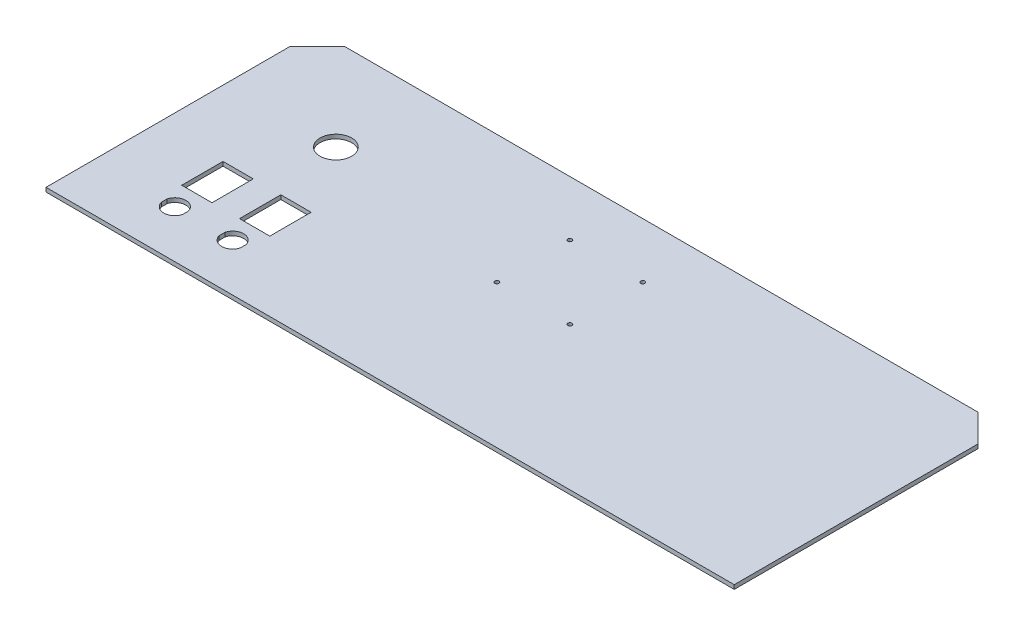
ISO-10303-21;
HEADER;
FILE_DESCRIPTION(('STEP AP214'),'2;1');
FILE_NAME('part.step','',(''),(''),'','','');
FILE_SCHEMA(('AUTOMOTIVE_DESIGN { 1 0 10303 214 1 1 1 1 }'));
ENDSEC;
DATA;
#1=APPLICATION_CONTEXT('core data for automotive mechanical design processes');
#2=APPLICATION_PROTOCOL_DEFINITION('international standard','automotive_design',2000,#1);
#3=PRODUCT_CONTEXT('',#1,'mechanical');
#4=PRODUCT('Part','Part','',(#3));
#5=PRODUCT_RELATED_PRODUCT_CATEGORY('part','',(#4));
#6=PRODUCT_DEFINITION_FORMATION('','',#4);
#7=PRODUCT_DEFINITION_CONTEXT('part definition',#1,'design');
#8=PRODUCT_DEFINITION('design','',#6,#7);
#9=PRODUCT_DEFINITION_SHAPE('','',#8);
#10=(LENGTH_UNIT() NAMED_UNIT(*) SI_UNIT(.MILLI.,.METRE.));
#11=(NAMED_UNIT(*) PLANE_ANGLE_UNIT() SI_UNIT($,.RADIAN.));
#12=(NAMED_UNIT(*) SI_UNIT($,.STERADIAN.) SOLID_ANGLE_UNIT());
#13=UNCERTAINTY_MEASURE_WITH_UNIT(LENGTH_MEASURE(1.E-05),#10,'distance_accuracy_value','');
#14=(GEOMETRIC_REPRESENTATION_CONTEXT(3) GLOBAL_UNCERTAINTY_ASSIGNED_CONTEXT((#13)) GLOBAL_UNIT_ASSIGNED_CONTEXT((#10,
#11,#12)) REPRESENTATION_CONTEXT('',''));
#15=CARTESIAN_POINT('',(0.,0.,0.));
#16=DIRECTION('',(0.,0.,1.));
#17=DIRECTION('',(1.,0.,0.));
#18=AXIS2_PLACEMENT_3D('',#15,#16,#17);
#19=CARTESIAN_POINT('',(0.,3.,0.));
#20=DIRECTION('',(0.,1.,0.));
#21=DIRECTION('',(0.,0.,1.));
#22=AXIS2_PLACEMENT_3D('',#19,#20,#21);
#23=PLANE('',#22);
#24=DIRECTION('',(0.,0.,-1.));
#25=VECTOR('',#24,1.);
#26=CARTESIAN_POINT('',(-172.230501234276,3.,0.));
#27=LINE('',#26,#25);
#28=CARTESIAN_POINT('',(-172.230501234276,3.,66.1202534414211));
#29=VERTEX_POINT('',#28);
#30=CARTESIAN_POINT('',(-172.230501234276,3.,61.779746558579));
#31=VERTEX_POINT('',#30);
#32=EDGE_CURVE('E49',#29,#31,#27,.T.);
#33=ORIENTED_EDGE('',*,*,#32,.F.);
#34=CARTESIAN_POINT('',(-179.930501234276,3.,63.95));
#35=DIRECTION('',(0.,1.,0.));
#36=DIRECTION('',(0.,0.,1.));
#37=AXIS2_PLACEMENT_3D('',#34,#35,#36);
#38=CIRCLE('',#37,8.00000000000001);
#39=CARTESIAN_POINT('',(-187.630501234276,3.,66.1202534414211));
#40=VERTEX_POINT('',#39);
#41=EDGE_CURVE('E204',#40,#29,#38,.T.);
#42=ORIENTED_EDGE('',*,*,#41,.F.);
#43=DIRECTION('',(0.,0.,-1.));
#44=VECTOR('',#43,1.);
#45=CARTESIAN_POINT('',(-187.630501234276,3.,0.));
#46=LINE('',#45,#44);
#47=CARTESIAN_POINT('',(-187.630501234276,3.,61.779746558579));
#48=VERTEX_POINT('',#47);
#49=EDGE_CURVE('E190',#40,#48,#46,.T.);
#50=ORIENTED_EDGE('',*,*,#49,.T.);
#51=EDGE_CURVE('E200',#31,#48,#38,.T.);
#52=ORIENTED_EDGE('',*,*,#51,.F.);
#53=EDGE_LOOP('',(#33,#42,#50,#52));
#54=FACE_BOUND('',#53,.T.);
#55=DIRECTION('',(0.,0.,-1.));
#56=VECTOR('',#55,1.);
#57=CARTESIAN_POINT('',(-214.230501234276,3.,0.));
#58=LINE('',#57,#56);
#59=CARTESIAN_POINT('',(-214.230501234276,3.,66.1202534414211));
#60=VERTEX_POINT('',#59);
#61=CARTESIAN_POINT('',(-214.230501234276,3.,61.779746558579));
#62=VERTEX_POINT('',#61);
#63=EDGE_CURVE('E57',#60,#62,#58,.T.);
#64=ORIENTED_EDGE('',*,*,#63,.F.);
#65=CARTESIAN_POINT('',(-221.930501234276,3.,63.95));
#66=DIRECTION('',(0.,1.,0.));
#67=DIRECTION('',(0.,0.,1.));
#68=AXIS2_PLACEMENT_3D('',#65,#66,#67);
#69=CIRCLE('',#68,8.00000000000001);
#70=CARTESIAN_POINT('',(-229.630501234276,3.,66.1202534414211));
#71=VERTEX_POINT('',#70);
#72=EDGE_CURVE('E232',#71,#60,#69,.T.);
#73=ORIENTED_EDGE('',*,*,#72,.F.);
#74=DIRECTION('',(0.,0.,-1.));
#75=VECTOR('',#74,1.);
#76=CARTESIAN_POINT('',(-229.630501234276,3.,0.));
#77=LINE('',#76,#75);
#78=CARTESIAN_POINT('',(-229.630501234276,3.,61.779746558579));
#79=VERTEX_POINT('',#78);
#80=EDGE_CURVE('E231',#71,#79,#77,.T.);
#81=ORIENTED_EDGE('',*,*,#80,.T.);
#82=EDGE_CURVE('E228',#62,#79,#69,.T.);
#83=ORIENTED_EDGE('',*,*,#82,.F.);
#84=EDGE_LOOP('',(#64,#73,#81,#83));
#85=FACE_BOUND('',#84,.T.);
#86=CARTESIAN_POINT('',(-200.930501234276,3.,-32.0500000000001));
#87=DIRECTION('',(0.,1.,0.));
#88=DIRECTION('',(0.,0.,1.));
#89=AXIS2_PLACEMENT_3D('',#86,#87,#88);
#90=CIRCLE('',#89,11.5);
#91=CARTESIAN_POINT('',(-200.930501234276,3.,-20.5500000000001));
#92=VERTEX_POINT('',#91);
#93=EDGE_CURVE('E273',#92,#92,#90,.T.);
#94=ORIENTED_EDGE('',*,*,#93,.F.);
#95=EDGE_LOOP('',(#94));
#96=FACE_BOUND('',#95,.T.);
#97=CARTESIAN_POINT('',(-57.4305012342762,3.,-5.55000000000012));
#98=DIRECTION('',(0.,1.,0.));
#99=DIRECTION('',(0.,0.,1.));
#100=AXIS2_PLACEMENT_3D('',#97,#98,#99);
#101=CIRCLE('',#100,1.5);
#102=CARTESIAN_POINT('',(-57.4305012342762,3.,-4.05000000000012));
#103=VERTEX_POINT('',#102);
#104=EDGE_CURVE('E326',#103,#103,#101,.T.);
#105=ORIENTED_EDGE('',*,*,#104,.F.);
#106=EDGE_LOOP('',(#105));
#107=FACE_BOUND('',#106,.T.);
#108=CARTESIAN_POINT('',(-57.4305012342762,3.,-58.5500000000001));
#109=DIRECTION('',(0.,1.,0.));
#110=DIRECTION('',(0.,0.,1.));
#111=AXIS2_PLACEMENT_3D('',#108,#109,#110);
#112=CIRCLE('',#111,1.5);
#113=CARTESIAN_POINT('',(-57.4305012342762,3.,-57.0500000000001));
#114=VERTEX_POINT('',#113);
#115=EDGE_CURVE('E319',#114,#114,#112,.T.);
#116=ORIENTED_EDGE('',*,*,#115,.F.);
#117=EDGE_LOOP('',(#116));
#118=FACE_BOUND('',#117,.T.);
#119=CARTESIAN_POINT('',(-4.43050123427619,3.,-58.5500000000001));
#120=DIRECTION('',(0.,1.,0.));
#121=DIRECTION('',(0.,0.,1.));
#122=AXIS2_PLACEMENT_3D('',#119,#120,#121);
#123=CIRCLE('',#122,1.5);
#124=CARTESIAN_POINT('',(-4.43050123427619,3.,-57.0500000000001));
#125=VERTEX_POINT('',#124);
#126=EDGE_CURVE('E318',#125,#125,#123,.T.);
#127=ORIENTED_EDGE('',*,*,#126,.F.);
#128=EDGE_LOOP('',(#127));
#129=FACE_BOUND('',#128,.T.);
#130=CARTESIAN_POINT('',(-4.43050123427619,3.,-5.55000000000012));
#131=DIRECTION('',(0.,1.,0.));
#132=DIRECTION('',(0.,0.,1.));
#133=AXIS2_PLACEMENT_3D('',#130,#131,#132);
#134=CIRCLE('',#133,1.5);
#135=CARTESIAN_POINT('',(-4.43050123427619,3.,-4.05000000000013));
#136=VERTEX_POINT('',#135);
#137=EDGE_CURVE('E322',#136,#136,#134,.T.);
#138=ORIENTED_EDGE('',*,*,#137,.F.);
#139=EDGE_LOOP('',(#138));
#140=FACE_BOUND('',#139,.T.);
#141=DIRECTION('',(-0.707106781186543,0.,-0.707106781186551));
#142=VECTOR('',#141,1.);
#143=CARTESIAN_POINT('',(199.069498765724,3.,-98.5500000000001));
#144=LINE('',#143,#142);
#145=CARTESIAN_POINT('',(219.069498765724,3.,-78.5499999999999));
#146=VERTEX_POINT('',#145);
#147=CARTESIAN_POINT('',(199.069498765724,3.,-98.5500000000001));
#148=VERTEX_POINT('',#147);
#149=EDGE_CURVE('E339',#146,#148,#144,.T.);
#150=ORIENTED_EDGE('',*,*,#149,.T.);
#151=DIRECTION('',(-1.,0.,0.));
#152=VECTOR('',#151,1.);
#153=CARTESIAN_POINT('',(-260.930501234276,3.,-98.5500000000001));
#154=LINE('',#153,#152);
#155=CARTESIAN_POINT('',(-260.930501234276,3.,-98.5500000000001));
#156=VERTEX_POINT('',#155);
#157=EDGE_CURVE('E342',#148,#156,#154,.T.);
#158=ORIENTED_EDGE('',*,*,#157,.T.);
#159=DIRECTION('',(-0.707106781186548,0.,0.707106781186546));
#160=VECTOR('',#159,1.);
#161=CARTESIAN_POINT('',(-280.930501234276,3.,-78.5500000000002));
#162=LINE('',#161,#160);
#163=CARTESIAN_POINT('',(-280.930501234276,3.,-78.5500000000002));
#164=VERTEX_POINT('',#163);
#165=EDGE_CURVE('E345',#156,#164,#162,.T.);
#166=ORIENTED_EDGE('',*,*,#165,.T.);
#167=DIRECTION('',(0.,0.,1.));
#168=VECTOR('',#167,1.);
#169=CARTESIAN_POINT('',(-280.930501234276,3.,98.5500000000001));
#170=LINE('',#169,#168);
#171=CARTESIAN_POINT('',(-280.930501234276,3.,98.5500000000001));
#172=VERTEX_POINT('',#171);
#173=EDGE_CURVE('E347',#164,#172,#170,.T.);
#174=ORIENTED_EDGE('',*,*,#173,.T.);
#175=DIRECTION('',(1.,0.,0.));
#176=VECTOR('',#175,1.);
#177=CARTESIAN_POINT('',(219.069498765724,3.,98.5500000000001));
#178=LINE('',#177,#176);
#179=CARTESIAN_POINT('',(219.069498765724,3.,98.5500000000001));
#180=VERTEX_POINT('',#179);
#181=EDGE_CURVE('E349',#172,#180,#178,.T.);
#182=ORIENTED_EDGE('',*,*,#181,.T.);
#183=DIRECTION('',(0.,0.,-1.));
#184=VECTOR('',#183,1.);
#185=CARTESIAN_POINT('',(219.069498765724,3.,-78.5499999999999));
#186=LINE('',#185,#184);
#187=EDGE_CURVE('E351',#180,#146,#186,.T.);
#188=ORIENTED_EDGE('',*,*,#187,.T.);
#189=EDGE_LOOP('',(#150,#158,#166,#174,#182,#188));
#190=FACE_BOUND('',#189,.T.);
#191=DIRECTION('',(0.,0.,1.));
#192=VECTOR('',#191,1.);
#193=CARTESIAN_POINT('',(-168.930501234276,3.,17.9499999999999));
#194=LINE('',#193,#192);
#195=CARTESIAN_POINT('',(-168.930501234276,3.,17.9499999999999));
#196=VERTEX_POINT('',#195);
#197=CARTESIAN_POINT('',(-168.930501234276,3.,47.9499999999999));
#198=VERTEX_POINT('',#197);
#199=EDGE_CURVE('E298',#196,#198,#194,.T.);
#200=ORIENTED_EDGE('',*,*,#199,.T.);
#201=DIRECTION('',(-1.,0.,0.));
#202=VECTOR('',#201,1.);
#203=CARTESIAN_POINT('',(-168.930501234276,3.,47.9499999999999));
#204=LINE('',#203,#202);
#205=CARTESIAN_POINT('',(-190.930501234276,3.,47.9499999999999));
#206=VERTEX_POINT('',#205);
#207=EDGE_CURVE('E301',#198,#206,#204,.T.);
#208=ORIENTED_EDGE('',*,*,#207,.T.);
#209=DIRECTION('',(0.,0.,-1.));
#210=VECTOR('',#209,1.);
#211=CARTESIAN_POINT('',(-190.930501234276,3.,47.9499999999999));
#212=LINE('',#211,#210);
#213=CARTESIAN_POINT('',(-190.930501234276,3.,17.9499999999999));
#214=VERTEX_POINT('',#213);
#215=EDGE_CURVE('E268',#206,#214,#212,.T.);
#216=ORIENTED_EDGE('',*,*,#215,.T.);
#217=DIRECTION('',(1.,0.,0.));
#218=VECTOR('',#217,1.);
#219=CARTESIAN_POINT('',(-190.930501234276,3.,17.9499999999999));
#220=LINE('',#219,#218);
#221=EDGE_CURVE('E295',#214,#196,#220,.T.);
#222=ORIENTED_EDGE('',*,*,#221,.T.);
#223=EDGE_LOOP('',(#200,#208,#216,#222));
#224=FACE_BOUND('',#223,.T.);
#225=DIRECTION('',(-1.,0.,0.));
#226=VECTOR('',#225,1.);
#227=CARTESIAN_POINT('',(-210.930501234276,3.,47.9499999999999));
#228=LINE('',#227,#226);
#229=CARTESIAN_POINT('',(-210.930501234276,3.,47.9499999999999));
#230=VERTEX_POINT('',#229);
#231=CARTESIAN_POINT('',(-232.930501234276,3.,47.9499999999999));
#232=VERTEX_POINT('',#231);
#233=EDGE_CURVE('E259',#230,#232,#228,.T.);
#234=ORIENTED_EDGE('',*,*,#233,.T.);
#235=DIRECTION('',(0.,0.,-1.));
#236=VECTOR('',#235,1.);
#237=CARTESIAN_POINT('',(-232.930501234276,3.,47.9499999999999));
#238=LINE('',#237,#236);
#239=CARTESIAN_POINT('',(-232.930501234276,3.,17.9499999999999));
#240=VERTEX_POINT('',#239);
#241=EDGE_CURVE('E256',#232,#240,#238,.T.);
#242=ORIENTED_EDGE('',*,*,#241,.T.);
#243=DIRECTION('',(1.,0.,0.));
#244=VECTOR('',#243,1.);
#245=CARTESIAN_POINT('',(-232.930501234276,3.,17.9499999999999));
#246=LINE('',#245,#244);
#247=CARTESIAN_POINT('',(-210.930501234276,3.,17.9499999999999));
#248=VERTEX_POINT('',#247);
#249=EDGE_CURVE('E265',#240,#248,#246,.T.);
#250=ORIENTED_EDGE('',*,*,#249,.T.);
#251=DIRECTION('',(0.,0.,1.));
#252=VECTOR('',#251,1.);
#253=CARTESIAN_POINT('',(-210.930501234276,3.,17.9499999999999));
#254=LINE('',#253,#252);
#255=EDGE_CURVE('E262',#248,#230,#254,.T.);
#256=ORIENTED_EDGE('',*,*,#255,.T.);
#257=EDGE_LOOP('',(#234,#242,#250,#256));
#258=FACE_BOUND('',#257,.T.);
#259=ADVANCED_FACE('F34',(#54,#85,#96,#107,#118,#129,#140,#190,#224,#258),#23,.T.);
#260=CARTESIAN_POINT('',(0.,0.,0.));
#261=DIRECTION('',(0.,1.,0.));
#262=DIRECTION('',(0.,0.,1.));
#263=AXIS2_PLACEMENT_3D('',#260,#261,#262);
#264=PLANE('',#263);
#265=CARTESIAN_POINT('',(-179.930501234276,0.,63.95));
#266=DIRECTION('',(0.,1.,0.));
#267=DIRECTION('',(0.,0.,1.));
#268=AXIS2_PLACEMENT_3D('',#265,#266,#267);
#269=CIRCLE('',#268,8.00000000000001);
#270=CARTESIAN_POINT('',(-172.230501234276,0.,66.1202534414211));
#271=VERTEX_POINT('',#270);
#272=CARTESIAN_POINT('',(-187.630501234276,0.,66.1202534414211));
#273=VERTEX_POINT('',#272);
#274=EDGE_CURVE('E739',#271,#273,#269,.F.);
#275=ORIENTED_EDGE('',*,*,#274,.F.);
#276=DIRECTION('',(0.,0.,1.));
#277=VECTOR('',#276,1.);
#278=CARTESIAN_POINT('',(-172.230501234276,0.,0.));
#279=LINE('',#278,#277);
#280=CARTESIAN_POINT('',(-172.230501234276,0.,61.779746558579));
#281=VERTEX_POINT('',#280);
#282=EDGE_CURVE('E217',#281,#271,#279,.T.);
#283=ORIENTED_EDGE('',*,*,#282,.F.);
#284=CARTESIAN_POINT('',(-179.930501234276,0.,63.95));
#285=DIRECTION('',(0.,1.,0.));
#286=DIRECTION('',(0.,0.,1.));
#287=AXIS2_PLACEMENT_3D('',#284,#285,#286);
#288=CIRCLE('',#287,8.00000000000001);
#289=CARTESIAN_POINT('',(-187.630501234276,0.,61.779746558579));
#290=VERTEX_POINT('',#289);
#291=EDGE_CURVE('E214',#290,#281,#288,.F.);
#292=ORIENTED_EDGE('',*,*,#291,.F.);
#293=DIRECTION('',(0.,0.,1.));
#294=VECTOR('',#293,1.);
#295=CARTESIAN_POINT('',(-187.630501234276,0.,0.));
#296=LINE('',#295,#294);
#297=EDGE_CURVE('E193',#290,#273,#296,.T.);
#298=ORIENTED_EDGE('',*,*,#297,.T.);
#299=EDGE_LOOP('',(#275,#283,#292,#298));
#300=FACE_BOUND('',#299,.T.);
#301=CARTESIAN_POINT('',(-221.930501234276,0.,63.95));
#302=DIRECTION('',(0.,1.,0.));
#303=DIRECTION('',(0.,0.,1.));
#304=AXIS2_PLACEMENT_3D('',#301,#302,#303);
#305=CIRCLE('',#304,8.00000000000001);
#306=CARTESIAN_POINT('',(-214.230501234276,0.,66.1202534414211));
#307=VERTEX_POINT('',#306);
#308=CARTESIAN_POINT('',(-229.630501234276,0.,66.1202534414211));
#309=VERTEX_POINT('',#308);
#310=EDGE_CURVE('E221',#307,#309,#305,.F.);
#311=ORIENTED_EDGE('',*,*,#310,.F.);
#312=DIRECTION('',(0.,0.,1.));
#313=VECTOR('',#312,1.);
#314=CARTESIAN_POINT('',(-214.230501234276,0.,0.));
#315=LINE('',#314,#313);
#316=CARTESIAN_POINT('',(-214.230501234276,0.,61.779746558579));
#317=VERTEX_POINT('',#316);
#318=EDGE_CURVE('E224',#317,#307,#315,.T.);
#319=ORIENTED_EDGE('',*,*,#318,.F.);
#320=CARTESIAN_POINT('',(-221.930501234276,0.,63.95));
#321=DIRECTION('',(0.,1.,0.));
#322=DIRECTION('',(0.,0.,1.));
#323=AXIS2_PLACEMENT_3D('',#320,#321,#322);
#324=CIRCLE('',#323,8.00000000000001);
#325=CARTESIAN_POINT('',(-229.630501234276,0.,61.779746558579));
#326=VERTEX_POINT('',#325);
#327=EDGE_CURVE('E226',#326,#317,#324,.F.);
#328=ORIENTED_EDGE('',*,*,#327,.F.);
#329=DIRECTION('',(0.,0.,1.));
#330=VECTOR('',#329,1.);
#331=CARTESIAN_POINT('',(-229.630501234276,0.,0.));
#332=LINE('',#331,#330);
#333=EDGE_CURVE('E218',#326,#309,#332,.T.);
#334=ORIENTED_EDGE('',*,*,#333,.T.);
#335=EDGE_LOOP('',(#311,#319,#328,#334));
#336=FACE_BOUND('',#335,.T.);
#337=CARTESIAN_POINT('',(-200.930501234276,0.,-32.0500000000001));
#338=DIRECTION('',(0.,1.,0.));
#339=DIRECTION('',(0.,0.,1.));
#340=AXIS2_PLACEMENT_3D('',#337,#338,#339);
#341=CIRCLE('',#340,11.5);
#342=CARTESIAN_POINT('',(-200.930501234276,0.,-20.5500000000001));
#343=VERTEX_POINT('',#342);
#344=EDGE_CURVE('E216',#343,#343,#341,.F.);
#345=ORIENTED_EDGE('',*,*,#344,.F.);
#346=EDGE_LOOP('',(#345));
#347=FACE_BOUND('',#346,.T.);
#348=DIRECTION('',(1.,0.,0.));
#349=VECTOR('',#348,1.);
#350=CARTESIAN_POINT('',(-168.930501234276,0.,47.9499999999999));
#351=LINE('',#350,#349);
#352=CARTESIAN_POINT('',(-190.930501234276,0.,47.9499999999999));
#353=VERTEX_POINT('',#352);
#354=CARTESIAN_POINT('',(-168.930501234276,0.,47.9499999999999));
#355=VERTEX_POINT('',#354);
#356=EDGE_CURVE('E286',#353,#355,#351,.T.);
#357=ORIENTED_EDGE('',*,*,#356,.T.);
#358=DIRECTION('',(0.,0.,-1.));
#359=VECTOR('',#358,1.);
#360=CARTESIAN_POINT('',(-168.930501234276,0.,17.9499999999999));
#361=LINE('',#360,#359);
#362=CARTESIAN_POINT('',(-168.930501234276,0.,17.9499999999999));
#363=VERTEX_POINT('',#362);
#364=EDGE_CURVE('E282',#355,#363,#361,.T.);
#365=ORIENTED_EDGE('',*,*,#364,.T.);
#366=DIRECTION('',(-1.,0.,0.));
#367=VECTOR('',#366,1.);
#368=CARTESIAN_POINT('',(-190.930501234276,0.,17.9499999999999));
#369=LINE('',#368,#367);
#370=CARTESIAN_POINT('',(-190.930501234276,0.,17.9499999999999));
#371=VERTEX_POINT('',#370);
#372=EDGE_CURVE('E285',#363,#371,#369,.T.);
#373=ORIENTED_EDGE('',*,*,#372,.T.);
#374=DIRECTION('',(0.,0.,1.));
#375=VECTOR('',#374,1.);
#376=CARTESIAN_POINT('',(-190.930501234276,0.,47.9499999999999));
#377=LINE('',#376,#375);
#378=EDGE_CURVE('E289',#371,#353,#377,.T.);
#379=ORIENTED_EDGE('',*,*,#378,.T.);
#380=EDGE_LOOP('',(#357,#365,#373,#379));
#381=FACE_BOUND('',#380,.T.);
#382=CARTESIAN_POINT('',(-57.4305012342762,0.,-5.55000000000012));
#383=DIRECTION('',(0.,1.,0.));
#384=DIRECTION('',(0.,0.,1.));
#385=AXIS2_PLACEMENT_3D('',#382,#383,#384);
#386=CIRCLE('',#385,1.5);
#387=CARTESIAN_POINT('',(-57.4305012342762,0.,-4.05000000000012));
#388=VERTEX_POINT('',#387);
#389=EDGE_CURVE('E292',#388,#388,#386,.F.);
#390=ORIENTED_EDGE('',*,*,#389,.F.);
#391=EDGE_LOOP('',(#390));
#392=FACE_BOUND('',#391,.T.);
#393=CARTESIAN_POINT('',(-57.4305012342762,0.,-58.5500000000001));
#394=DIRECTION('',(0.,1.,0.));
#395=DIRECTION('',(0.,0.,1.));
#396=AXIS2_PLACEMENT_3D('',#393,#394,#395);
#397=CIRCLE('',#396,1.5);
#398=CARTESIAN_POINT('',(-57.4305012342762,0.,-57.0500000000001));
#399=VERTEX_POINT('',#398);
#400=EDGE_CURVE('E323',#399,#399,#397,.F.);
#401=ORIENTED_EDGE('',*,*,#400,.F.);
#402=EDGE_LOOP('',(#401));
#403=FACE_BOUND('',#402,.T.);
#404=CARTESIAN_POINT('',(-4.43050123427619,0.,-58.5500000000001));
#405=DIRECTION('',(0.,1.,0.));
#406=DIRECTION('',(0.,0.,1.));
#407=AXIS2_PLACEMENT_3D('',#404,#405,#406);
#408=CIRCLE('',#407,1.5);
#409=CARTESIAN_POINT('',(-4.43050123427619,0.,-57.0500000000001));
#410=VERTEX_POINT('',#409);
#411=EDGE_CURVE('E315',#410,#410,#408,.F.);
#412=ORIENTED_EDGE('',*,*,#411,.F.);
#413=EDGE_LOOP('',(#412));
#414=FACE_BOUND('',#413,.T.);
#415=CARTESIAN_POINT('',(-4.43050123427619,0.,-5.55000000000012));
#416=DIRECTION('',(0.,1.,0.));
#417=DIRECTION('',(0.,0.,1.));
#418=AXIS2_PLACEMENT_3D('',#415,#416,#417);
#419=CIRCLE('',#418,1.5);
#420=CARTESIAN_POINT('',(-4.43050123427619,0.,-4.05000000000013));
#421=VERTEX_POINT('',#420);
#422=EDGE_CURVE('E335',#421,#421,#419,.F.);
#423=ORIENTED_EDGE('',*,*,#422,.F.);
#424=EDGE_LOOP('',(#423));
#425=FACE_BOUND('',#424,.T.);
#426=DIRECTION('',(-0.707106781186543,0.,-0.707106781186551));
#427=VECTOR('',#426,1.);
#428=CARTESIAN_POINT('',(199.069498765724,0.,-98.5500000000001));
#429=LINE('',#428,#427);
#430=CARTESIAN_POINT('',(219.069498765724,0.,-78.5499999999999));
#431=VERTEX_POINT('',#430);
#432=CARTESIAN_POINT('',(199.069498765724,0.,-98.5500000000001));
#433=VERTEX_POINT('',#432);
#434=EDGE_CURVE('E338',#431,#433,#429,.T.);
#435=ORIENTED_EDGE('',*,*,#434,.F.);
#436=DIRECTION('',(0.,0.,-1.));
#437=VECTOR('',#436,1.);
#438=CARTESIAN_POINT('',(219.069498765724,0.,-78.5499999999999));
#439=LINE('',#438,#437);
#440=CARTESIAN_POINT('',(219.069498765724,0.,98.5500000000001));
#441=VERTEX_POINT('',#440);
#442=EDGE_CURVE('E343',#441,#431,#439,.T.);
#443=ORIENTED_EDGE('',*,*,#442,.F.);
#444=DIRECTION('',(1.,0.,0.));
#445=VECTOR('',#444,1.);
#446=CARTESIAN_POINT('',(219.069498765724,0.,98.5500000000001));
#447=LINE('',#446,#445);
#448=CARTESIAN_POINT('',(-280.930501234276,0.,98.5500000000001));
#449=VERTEX_POINT('',#448);
#450=EDGE_CURVE('E362',#449,#441,#447,.T.);
#451=ORIENTED_EDGE('',*,*,#450,.F.);
#452=DIRECTION('',(0.,0.,1.));
#453=VECTOR('',#452,1.);
#454=CARTESIAN_POINT('',(-280.930501234276,0.,98.5500000000001));
#455=LINE('',#454,#453);
#456=CARTESIAN_POINT('',(-280.930501234276,0.,-78.5500000000002));
#457=VERTEX_POINT('',#456);
#458=EDGE_CURVE('E360',#457,#449,#455,.T.);
#459=ORIENTED_EDGE('',*,*,#458,.F.);
#460=DIRECTION('',(-0.707106781186548,0.,0.707106781186546));
#461=VECTOR('',#460,1.);
#462=CARTESIAN_POINT('',(-280.930501234276,0.,-78.5500000000002));
#463=LINE('',#462,#461);
#464=CARTESIAN_POINT('',(-260.930501234276,0.,-98.5500000000001));
#465=VERTEX_POINT('',#464);
#466=EDGE_CURVE('E358',#465,#457,#463,.T.);
#467=ORIENTED_EDGE('',*,*,#466,.F.);
#468=DIRECTION('',(-1.,0.,0.));
#469=VECTOR('',#468,1.);
#470=CARTESIAN_POINT('',(-260.930501234276,0.,-98.5500000000001));
#471=LINE('',#470,#469);
#472=EDGE_CURVE('E356',#433,#465,#471,.T.);
#473=ORIENTED_EDGE('',*,*,#472,.F.);
#474=EDGE_LOOP('',(#435,#443,#451,#459,#467,#473));
#475=FACE_BOUND('',#474,.T.);
#476=DIRECTION('',(0.,0.,1.));
#477=VECTOR('',#476,1.);
#478=CARTESIAN_POINT('',(-232.930501234276,0.,47.9499999999999));
#479=LINE('',#478,#477);
#480=CARTESIAN_POINT('',(-232.930501234276,0.,17.9499999999999));
#481=VERTEX_POINT('',#480);
#482=CARTESIAN_POINT('',(-232.930501234276,0.,47.9499999999999));
#483=VERTEX_POINT('',#482);
#484=EDGE_CURVE('E243',#481,#483,#479,.T.);
#485=ORIENTED_EDGE('',*,*,#484,.T.);
#486=DIRECTION('',(1.,0.,0.));
#487=VECTOR('',#486,1.);
#488=CARTESIAN_POINT('',(-210.930501234276,0.,47.9499999999999));
#489=LINE('',#488,#487);
#490=CARTESIAN_POINT('',(-210.930501234276,0.,47.9499999999999));
#491=VERTEX_POINT('',#490);
#492=EDGE_CURVE('E247',#483,#491,#489,.T.);
#493=ORIENTED_EDGE('',*,*,#492,.T.);
#494=DIRECTION('',(0.,0.,-1.));
#495=VECTOR('',#494,1.);
#496=CARTESIAN_POINT('',(-210.930501234276,0.,17.9499999999999));
#497=LINE('',#496,#495);
#498=CARTESIAN_POINT('',(-210.930501234276,0.,17.9499999999999));
#499=VERTEX_POINT('',#498);
#500=EDGE_CURVE('E272',#491,#499,#497,.T.);
#501=ORIENTED_EDGE('',*,*,#500,.T.);
#502=DIRECTION('',(-1.,0.,0.));
#503=VECTOR('',#502,1.);
#504=CARTESIAN_POINT('',(-232.930501234276,0.,17.9499999999999));
#505=LINE('',#504,#503);
#506=EDGE_CURVE('E269',#499,#481,#505,.T.);
#507=ORIENTED_EDGE('',*,*,#506,.T.);
#508=EDGE_LOOP('',(#485,#493,#501,#507));
#509=FACE_BOUND('',#508,.T.);
#510=ADVANCED_FACE('F386',(#300,#336,#347,#381,#392,#403,#414,#425,#475,#509),#264,.F.);
#511=CARTESIAN_POINT('',(199.069498765724,3.,-98.5500000000001));
#512=DIRECTION('',(-0.707106781186551,0.,0.707106781186543));
#513=DIRECTION('',(0.707106781186544,0.,0.707106781186552));
#514=AXIS2_PLACEMENT_3D('',#511,#512,#513);
#515=PLANE('',#514);
#516=ORIENTED_EDGE('',*,*,#434,.T.);
#517=DIRECTION('',(0.,-1.,0.));
#518=VECTOR('',#517,1.);
#519=CARTESIAN_POINT('',(199.069498765724,3.,-98.5500000000001));
#520=LINE('',#519,#518);
#521=EDGE_CURVE('E11',#148,#433,#520,.T.);
#522=ORIENTED_EDGE('',*,*,#521,.F.);
#523=ORIENTED_EDGE('',*,*,#149,.F.);
#524=DIRECTION('',(0.,-1.,0.));
#525=VECTOR('',#524,1.);
#526=CARTESIAN_POINT('',(219.069498765724,3.,-78.5499999999999));
#527=LINE('',#526,#525);
#528=EDGE_CURVE('E353',#146,#431,#527,.T.);
#529=ORIENTED_EDGE('',*,*,#528,.T.);
#530=EDGE_LOOP('',(#516,#522,#523,#529));
#531=FACE_BOUND('',#530,.T.);
#532=ADVANCED_FACE('F36',(#531),#515,.F.);
#533=CARTESIAN_POINT('',(-260.930501234276,3.,-98.5500000000001));
#534=DIRECTION('',(0.,0.,1.));
#535=DIRECTION('',(1.,0.,0.));
#536=AXIS2_PLACEMENT_3D('',#533,#534,#535);
#537=PLANE('',#536);
#538=ORIENTED_EDGE('',*,*,#472,.T.);
#539=DIRECTION('',(0.,-1.,0.));
#540=VECTOR('',#539,1.);
#541=CARTESIAN_POINT('',(-260.930501234276,3.,-98.5500000000001));
#542=LINE('',#541,#540);
#543=EDGE_CURVE('E42',#156,#465,#542,.T.);
#544=ORIENTED_EDGE('',*,*,#543,.F.);
#545=ORIENTED_EDGE('',*,*,#157,.F.);
#546=ORIENTED_EDGE('',*,*,#521,.T.);
#547=EDGE_LOOP('',(#538,#544,#545,#546));
#548=FACE_BOUND('',#547,.T.);
#549=ADVANCED_FACE('F404',(#548),#537,.F.);
#550=CARTESIAN_POINT('',(-280.930501234276,3.,-78.5500000000002));
#551=DIRECTION('',(0.707106781186547,0.,0.707106781186549));
#552=DIRECTION('',(0.707106781186549,0.,-0.707106781186547));
#553=AXIS2_PLACEMENT_3D('',#550,#551,#552);
#554=PLANE('',#553);
#555=ORIENTED_EDGE('',*,*,#466,.T.);
#556=DIRECTION('',(0.,-1.,0.));
#557=VECTOR('',#556,1.);
#558=CARTESIAN_POINT('',(-280.930501234276,3.,-78.5500000000002));
#559=LINE('',#558,#557);
#560=EDGE_CURVE('E373',#164,#457,#559,.T.);
#561=ORIENTED_EDGE('',*,*,#560,.F.);
#562=ORIENTED_EDGE('',*,*,#165,.F.);
#563=ORIENTED_EDGE('',*,*,#543,.T.);
#564=EDGE_LOOP('',(#555,#561,#562,#563));
#565=FACE_BOUND('',#564,.T.);
#566=ADVANCED_FACE('F380',(#565),#554,.F.);
#567=CARTESIAN_POINT('',(-280.930501234276,3.,98.5500000000001));
#568=DIRECTION('',(1.,0.,0.));
#569=DIRECTION('',(0.,0.,-1.));
#570=AXIS2_PLACEMENT_3D('',#567,#568,#569);
#571=PLANE('',#570);
#572=ORIENTED_EDGE('',*,*,#458,.T.);
#573=DIRECTION('',(0.,-1.,0.));
#574=VECTOR('',#573,1.);
#575=CARTESIAN_POINT('',(-280.930501234276,3.,98.5500000000001));
#576=LINE('',#575,#574);
#577=EDGE_CURVE('E370',#172,#449,#576,.T.);
#578=ORIENTED_EDGE('',*,*,#577,.F.);
#579=ORIENTED_EDGE('',*,*,#173,.F.);
#580=ORIENTED_EDGE('',*,*,#560,.T.);
#581=EDGE_LOOP('',(#572,#578,#579,#580));
#582=FACE_BOUND('',#581,.T.);
#583=ADVANCED_FACE('F392',(#582),#571,.F.);
#584=CARTESIAN_POINT('',(219.069498765724,3.,98.5500000000001));
#585=DIRECTION('',(0.,0.,-1.));
#586=DIRECTION('',(-1.,0.,0.));
#587=AXIS2_PLACEMENT_3D('',#584,#585,#586);
#588=PLANE('',#587);
#589=ORIENTED_EDGE('',*,*,#450,.T.);
#590=DIRECTION('',(0.,-1.,0.));
#591=VECTOR('',#590,1.);
#592=CARTESIAN_POINT('',(219.069498765724,3.,98.5500000000001));
#593=LINE('',#592,#591);
#594=EDGE_CURVE('E367',#180,#441,#593,.T.);
#595=ORIENTED_EDGE('',*,*,#594,.F.);
#596=ORIENTED_EDGE('',*,*,#181,.F.);
#597=ORIENTED_EDGE('',*,*,#577,.T.);
#598=EDGE_LOOP('',(#589,#595,#596,#597));
#599=FACE_BOUND('',#598,.T.);
#600=ADVANCED_FACE('F396',(#599),#588,.F.);
#601=CARTESIAN_POINT('',(219.069498765724,3.,-78.5499999999999));
#602=DIRECTION('',(-1.,0.,0.));
#603=DIRECTION('',(0.,0.,1.));
#604=AXIS2_PLACEMENT_3D('',#601,#602,#603);
#605=PLANE('',#604);
#606=ORIENTED_EDGE('',*,*,#442,.T.);
#607=ORIENTED_EDGE('',*,*,#528,.F.);
#608=ORIENTED_EDGE('',*,*,#187,.F.);
#609=ORIENTED_EDGE('',*,*,#594,.T.);
#610=EDGE_LOOP('',(#606,#607,#608,#609));
#611=FACE_BOUND('',#610,.T.);
#612=ADVANCED_FACE('F407',(#611),#605,.F.);
#613=CARTESIAN_POINT('',(-4.43050123427619,-4.24264068711929,-5.55000000000012));
#614=DIRECTION('',(0.,1.,0.));
#615=DIRECTION('',(0.,0.,1.));
#616=AXIS2_PLACEMENT_3D('',#613,#614,#615);
#617=CYLINDRICAL_SURFACE('',#616,1.5);
#618=ORIENTED_EDGE('',*,*,#422,.T.);
#619=EDGE_LOOP('',(#618));
#620=FACE_BOUND('',#619,.T.);
#621=ORIENTED_EDGE('',*,*,#137,.T.);
#622=EDGE_LOOP('',(#621));
#623=FACE_BOUND('',#622,.T.);
#624=ADVANCED_FACE('F409',(#620,#623),#617,.F.);
#625=CARTESIAN_POINT('',(-4.43050123427619,-4.24264068711929,-58.5500000000001));
#626=DIRECTION('',(0.,1.,0.));
#627=DIRECTION('',(0.,0.,1.));
#628=AXIS2_PLACEMENT_3D('',#625,#626,#627);
#629=CYLINDRICAL_SURFACE('',#628,1.5);
#630=ORIENTED_EDGE('',*,*,#411,.T.);
#631=EDGE_LOOP('',(#630));
#632=FACE_BOUND('',#631,.T.);
#633=ORIENTED_EDGE('',*,*,#126,.T.);
#634=EDGE_LOOP('',(#633));
#635=FACE_BOUND('',#634,.T.);
#636=ADVANCED_FACE('F415',(#632,#635),#629,.F.);
#637=CARTESIAN_POINT('',(-57.4305012342762,-4.24264068711929,-58.5500000000001));
#638=DIRECTION('',(0.,1.,0.));
#639=DIRECTION('',(0.,0.,1.));
#640=AXIS2_PLACEMENT_3D('',#637,#638,#639);
#641=CYLINDRICAL_SURFACE('',#640,1.5);
#642=ORIENTED_EDGE('',*,*,#400,.T.);
#643=EDGE_LOOP('',(#642));
#644=FACE_BOUND('',#643,.T.);
#645=ORIENTED_EDGE('',*,*,#115,.T.);
#646=EDGE_LOOP('',(#645));
#647=FACE_BOUND('',#646,.T.);
#648=ADVANCED_FACE('F431',(#644,#647),#641,.F.);
#649=CARTESIAN_POINT('',(-57.4305012342762,-4.24264068711929,-5.55000000000012));
#650=DIRECTION('',(0.,1.,0.));
#651=DIRECTION('',(0.,0.,1.));
#652=AXIS2_PLACEMENT_3D('',#649,#650,#651);
#653=CYLINDRICAL_SURFACE('',#652,1.5);
#654=ORIENTED_EDGE('',*,*,#389,.T.);
#655=EDGE_LOOP('',(#654));
#656=FACE_BOUND('',#655,.T.);
#657=ORIENTED_EDGE('',*,*,#104,.T.);
#658=EDGE_LOOP('',(#657));
#659=FACE_BOUND('',#658,.T.);
#660=ADVANCED_FACE('F427',(#656,#659),#653,.F.);
#661=CARTESIAN_POINT('',(-168.930501234276,-37.2021504754766,47.9499999999999));
#662=DIRECTION('',(0.,0.,-1.));
#663=DIRECTION('',(-1.,0.,0.));
#664=AXIS2_PLACEMENT_3D('',#661,#662,#663);
#665=PLANE('',#664);
#666=DIRECTION('',(0.,1.,0.));
#667=VECTOR('',#666,1.);
#668=CARTESIAN_POINT('',(-190.930501234276,-37.2021504754766,47.9499999999999));
#669=LINE('',#668,#667);
#670=EDGE_CURVE('E304',#353,#206,#669,.T.);
#671=ORIENTED_EDGE('',*,*,#670,.T.);
#672=ORIENTED_EDGE('',*,*,#207,.F.);
#673=DIRECTION('',(0.,1.,0.));
#674=VECTOR('',#673,1.);
#675=CARTESIAN_POINT('',(-168.930501234276,-37.2021504754766,47.9499999999999));
#676=LINE('',#675,#674);
#677=EDGE_CURVE('E306',#355,#198,#676,.T.);
#678=ORIENTED_EDGE('',*,*,#677,.F.);
#679=ORIENTED_EDGE('',*,*,#356,.F.);
#680=EDGE_LOOP('',(#671,#672,#678,#679));
#681=FACE_BOUND('',#680,.T.);
#682=ADVANCED_FACE('F430',(#681),#665,.T.);
#683=CARTESIAN_POINT('',(-168.930501234276,-37.2021504754766,17.9499999999999));
#684=DIRECTION('',(-1.,0.,0.));
#685=DIRECTION('',(0.,0.,1.));
#686=AXIS2_PLACEMENT_3D('',#683,#684,#685);
#687=PLANE('',#686);
#688=ORIENTED_EDGE('',*,*,#677,.T.);
#689=ORIENTED_EDGE('',*,*,#199,.F.);
#690=DIRECTION('',(0.,1.,0.));
#691=VECTOR('',#690,1.);
#692=CARTESIAN_POINT('',(-168.930501234276,-37.2021504754766,17.9499999999999));
#693=LINE('',#692,#691);
#694=EDGE_CURVE('E308',#363,#196,#693,.T.);
#695=ORIENTED_EDGE('',*,*,#694,.F.);
#696=ORIENTED_EDGE('',*,*,#364,.F.);
#697=EDGE_LOOP('',(#688,#689,#695,#696));
#698=FACE_BOUND('',#697,.T.);
#699=ADVANCED_FACE('F447',(#698),#687,.T.);
#700=CARTESIAN_POINT('',(-190.930501234276,-37.2021504754766,17.9499999999999));
#701=DIRECTION('',(0.,0.,1.));
#702=DIRECTION('',(1.,0.,0.));
#703=AXIS2_PLACEMENT_3D('',#700,#701,#702);
#704=PLANE('',#703);
#705=ORIENTED_EDGE('',*,*,#694,.T.);
#706=ORIENTED_EDGE('',*,*,#221,.F.);
#707=DIRECTION('',(0.,1.,0.));
#708=VECTOR('',#707,1.);
#709=CARTESIAN_POINT('',(-190.930501234276,-37.2021504754766,17.9499999999999));
#710=LINE('',#709,#708);
#711=EDGE_CURVE('E310',#371,#214,#710,.T.);
#712=ORIENTED_EDGE('',*,*,#711,.F.);
#713=ORIENTED_EDGE('',*,*,#372,.F.);
#714=EDGE_LOOP('',(#705,#706,#712,#713));
#715=FACE_BOUND('',#714,.T.);
#716=ADVANCED_FACE('F443',(#715),#704,.T.);
#717=CARTESIAN_POINT('',(-190.930501234276,-37.2021504754766,47.9499999999999));
#718=DIRECTION('',(1.,0.,0.));
#719=DIRECTION('',(0.,0.,-1.));
#720=AXIS2_PLACEMENT_3D('',#717,#718,#719);
#721=PLANE('',#720);
#722=ORIENTED_EDGE('',*,*,#711,.T.);
#723=ORIENTED_EDGE('',*,*,#215,.F.);
#724=ORIENTED_EDGE('',*,*,#670,.F.);
#725=ORIENTED_EDGE('',*,*,#378,.F.);
#726=EDGE_LOOP('',(#722,#723,#724,#725));
#727=FACE_BOUND('',#726,.T.);
#728=ADVANCED_FACE('F439',(#727),#721,.T.);
#729=CARTESIAN_POINT('',(-232.930501234276,-37.2021504754766,47.9499999999999));
#730=DIRECTION('',(1.,0.,0.));
#731=DIRECTION('',(0.,0.,-1.));
#732=AXIS2_PLACEMENT_3D('',#729,#730,#731);
#733=PLANE('',#732);
#734=DIRECTION('',(0.,1.,0.));
#735=VECTOR('',#734,1.);
#736=CARTESIAN_POINT('',(-232.930501234276,-37.2021504754766,17.9499999999999));
#737=LINE('',#736,#735);
#738=EDGE_CURVE('E254',#481,#240,#737,.T.);
#739=ORIENTED_EDGE('',*,*,#738,.T.);
#740=ORIENTED_EDGE('',*,*,#241,.F.);
#741=DIRECTION('',(0.,1.,0.));
#742=VECTOR('',#741,1.);
#743=CARTESIAN_POINT('',(-232.930501234276,-37.2021504754766,47.9499999999999));
#744=LINE('',#743,#742);
#745=EDGE_CURVE('E252',#483,#232,#744,.T.);
#746=ORIENTED_EDGE('',*,*,#745,.F.);
#747=ORIENTED_EDGE('',*,*,#484,.F.);
#748=EDGE_LOOP('',(#739,#740,#746,#747));
#749=FACE_BOUND('',#748,.T.);
#750=ADVANCED_FACE('F442',(#749),#733,.T.);
#751=CARTESIAN_POINT('',(-210.930501234276,-37.2021504754766,47.9499999999999));
#752=DIRECTION('',(0.,0.,-1.));
#753=DIRECTION('',(-1.,0.,0.));
#754=AXIS2_PLACEMENT_3D('',#751,#752,#753);
#755=PLANE('',#754);
#756=ORIENTED_EDGE('',*,*,#745,.T.);
#757=ORIENTED_EDGE('',*,*,#233,.F.);
#758=DIRECTION('',(0.,1.,0.));
#759=VECTOR('',#758,1.);
#760=CARTESIAN_POINT('',(-210.930501234276,-37.2021504754766,47.9499999999999));
#761=LINE('',#760,#759);
#762=EDGE_CURVE('E250',#491,#230,#761,.T.);
#763=ORIENTED_EDGE('',*,*,#762,.F.);
#764=ORIENTED_EDGE('',*,*,#492,.F.);
#765=EDGE_LOOP('',(#756,#757,#763,#764));
#766=FACE_BOUND('',#765,.T.);
#767=ADVANCED_FACE('F463',(#766),#755,.T.);
#768=CARTESIAN_POINT('',(-210.930501234276,-37.2021504754766,17.9499999999999));
#769=DIRECTION('',(-1.,0.,0.));
#770=DIRECTION('',(0.,0.,1.));
#771=AXIS2_PLACEMENT_3D('',#768,#769,#770);
#772=PLANE('',#771);
#773=ORIENTED_EDGE('',*,*,#762,.T.);
#774=ORIENTED_EDGE('',*,*,#255,.F.);
#775=DIRECTION('',(0.,1.,0.));
#776=VECTOR('',#775,1.);
#777=CARTESIAN_POINT('',(-210.930501234276,-37.2021504754766,17.9499999999999));
#778=LINE('',#777,#776);
#779=EDGE_CURVE('E246',#499,#248,#778,.T.);
#780=ORIENTED_EDGE('',*,*,#779,.F.);
#781=ORIENTED_EDGE('',*,*,#500,.F.);
#782=EDGE_LOOP('',(#773,#774,#780,#781));
#783=FACE_BOUND('',#782,.T.);
#784=ADVANCED_FACE('F467',(#783),#772,.T.);
#785=CARTESIAN_POINT('',(-232.930501234276,-37.2021504754766,17.9499999999999));
#786=DIRECTION('',(0.,0.,1.));
#787=DIRECTION('',(1.,0.,0.));
#788=AXIS2_PLACEMENT_3D('',#785,#786,#787);
#789=PLANE('',#788);
#790=ORIENTED_EDGE('',*,*,#779,.T.);
#791=ORIENTED_EDGE('',*,*,#249,.F.);
#792=ORIENTED_EDGE('',*,*,#738,.F.);
#793=ORIENTED_EDGE('',*,*,#506,.F.);
#794=EDGE_LOOP('',(#790,#791,#792,#793));
#795=FACE_BOUND('',#794,.T.);
#796=ADVANCED_FACE('F459',(#795),#789,.T.);
#797=CARTESIAN_POINT('',(-200.930501234276,-37.2021504754766,-32.0500000000001));
#798=DIRECTION('',(0.,1.,0.));
#799=DIRECTION('',(0.,0.,1.));
#800=AXIS2_PLACEMENT_3D('',#797,#798,#799);
#801=CYLINDRICAL_SURFACE('',#800,11.5);
#802=ORIENTED_EDGE('',*,*,#344,.T.);
#803=EDGE_LOOP('',(#802));
#804=FACE_BOUND('',#803,.T.);
#805=ORIENTED_EDGE('',*,*,#93,.T.);
#806=EDGE_LOOP('',(#805));
#807=FACE_BOUND('',#806,.T.);
#808=ADVANCED_FACE('F455',(#804,#807),#801,.F.);
#809=CARTESIAN_POINT('',(-214.230501234276,-22.2072060376807,0.));
#810=DIRECTION('',(1.,0.,0.));
#811=DIRECTION('',(0.,0.,-1.));
#812=AXIS2_PLACEMENT_3D('',#809,#810,#811);
#813=PLANE('',#812);
#814=ORIENTED_EDGE('',*,*,#318,.T.);
#815=DIRECTION('',(0.,1.,0.));
#816=VECTOR('',#815,1.);
#817=CARTESIAN_POINT('',(-214.230501234276,-22.2072060376807,66.1202534414211));
#818=LINE('',#817,#816);
#819=EDGE_CURVE('E222',#307,#60,#818,.T.);
#820=ORIENTED_EDGE('',*,*,#819,.T.);
#821=ORIENTED_EDGE('',*,*,#63,.T.);
#822=DIRECTION('',(0.,1.,0.));
#823=VECTOR('',#822,1.);
#824=CARTESIAN_POINT('',(-214.230501234276,-22.2072060376807,61.779746558579));
#825=LINE('',#824,#823);
#826=EDGE_CURVE('E240',#317,#62,#825,.T.);
#827=ORIENTED_EDGE('',*,*,#826,.F.);
#828=EDGE_LOOP('',(#814,#820,#821,#827));
#829=FACE_BOUND('',#828,.T.);
#830=ADVANCED_FACE('F458',(#829),#813,.F.);
#831=CARTESIAN_POINT('',(-221.930501234276,-22.2072060376807,63.95));
#832=DIRECTION('',(0.,1.,0.));
#833=DIRECTION('',(0.,0.,1.));
#834=AXIS2_PLACEMENT_3D('',#831,#832,#833);
#835=CYLINDRICAL_SURFACE('',#834,8.00000000000001);
#836=ORIENTED_EDGE('',*,*,#310,.T.);
#837=DIRECTION('',(0.,1.,0.));
#838=VECTOR('',#837,1.);
#839=CARTESIAN_POINT('',(-229.630501234276,-22.2072060376807,66.1202534414211));
#840=LINE('',#839,#838);
#841=EDGE_CURVE('E236',#309,#71,#840,.T.);
#842=ORIENTED_EDGE('',*,*,#841,.T.);
#843=ORIENTED_EDGE('',*,*,#72,.T.);
#844=ORIENTED_EDGE('',*,*,#819,.F.);
#845=EDGE_LOOP('',(#836,#842,#843,#844));
#846=FACE_BOUND('',#845,.T.);
#847=ADVANCED_FACE('F477',(#846),#835,.F.);
#848=CARTESIAN_POINT('',(-229.630501234276,-22.2072060376807,0.));
#849=DIRECTION('',(1.,0.,0.));
#850=DIRECTION('',(0.,0.,-1.));
#851=AXIS2_PLACEMENT_3D('',#848,#849,#850);
#852=PLANE('',#851);
#853=DIRECTION('',(0.,1.,0.));
#854=VECTOR('',#853,1.);
#855=CARTESIAN_POINT('',(-229.630501234276,-22.2072060376807,61.779746558579));
#856=LINE('',#855,#854);
#857=EDGE_CURVE('E238',#326,#79,#856,.T.);
#858=ORIENTED_EDGE('',*,*,#857,.T.);
#859=ORIENTED_EDGE('',*,*,#80,.F.);
#860=ORIENTED_EDGE('',*,*,#841,.F.);
#861=ORIENTED_EDGE('',*,*,#333,.F.);
#862=EDGE_LOOP('',(#858,#859,#860,#861));
#863=FACE_BOUND('',#862,.T.);
#864=ADVANCED_FACE('F478',(#863),#852,.T.);
#865=ORIENTED_EDGE('',*,*,#327,.T.);
#866=ORIENTED_EDGE('',*,*,#826,.T.);
#867=ORIENTED_EDGE('',*,*,#82,.T.);
#868=ORIENTED_EDGE('',*,*,#857,.F.);
#869=EDGE_LOOP('',(#865,#866,#867,#868));
#870=FACE_BOUND('',#869,.T.);
#871=ADVANCED_FACE('F481',(#870),#835,.F.);
#872=CARTESIAN_POINT('',(-172.230501234276,-22.2072060376807,0.));
#873=DIRECTION('',(1.,0.,0.));
#874=DIRECTION('',(0.,0.,-1.));
#875=AXIS2_PLACEMENT_3D('',#872,#873,#874);
#876=PLANE('',#875);
#877=ORIENTED_EDGE('',*,*,#282,.T.);
#878=DIRECTION('',(0.,1.,0.));
#879=VECTOR('',#878,1.);
#880=CARTESIAN_POINT('',(-172.230501234276,-22.2072060376807,66.1202534414211));
#881=LINE('',#880,#879);
#882=EDGE_CURVE('E210',#271,#29,#881,.T.);
#883=ORIENTED_EDGE('',*,*,#882,.T.);
#884=ORIENTED_EDGE('',*,*,#32,.T.);
#885=DIRECTION('',(0.,1.,0.));
#886=VECTOR('',#885,1.);
#887=CARTESIAN_POINT('',(-172.230501234276,-22.2072060376807,61.779746558579));
#888=LINE('',#887,#886);
#889=EDGE_CURVE('E197',#281,#31,#888,.T.);
#890=ORIENTED_EDGE('',*,*,#889,.F.);
#891=EDGE_LOOP('',(#877,#883,#884,#890));
#892=FACE_BOUND('',#891,.T.);
#893=ADVANCED_FACE('F486',(#892),#876,.F.);
#894=CARTESIAN_POINT('',(-179.930501234276,-22.2072060376807,63.95));
#895=DIRECTION('',(0.,1.,0.));
#896=DIRECTION('',(0.,0.,1.));
#897=AXIS2_PLACEMENT_3D('',#894,#895,#896);
#898=CYLINDRICAL_SURFACE('',#897,8.00000000000001);
#899=ORIENTED_EDGE('',*,*,#274,.T.);
#900=DIRECTION('',(0.,1.,0.));
#901=VECTOR('',#900,1.);
#902=CARTESIAN_POINT('',(-187.630501234276,-22.2072060376807,66.1202534414211));
#903=LINE('',#902,#901);
#904=EDGE_CURVE('E196',#273,#40,#903,.T.);
#905=ORIENTED_EDGE('',*,*,#904,.T.);
#906=ORIENTED_EDGE('',*,*,#41,.T.);
#907=ORIENTED_EDGE('',*,*,#882,.F.);
#908=EDGE_LOOP('',(#899,#905,#906,#907));
#909=FACE_BOUND('',#908,.T.);
#910=ADVANCED_FACE('F489',(#909),#898,.F.);
#911=CARTESIAN_POINT('',(-187.630501234276,-22.2072060376807,0.));
#912=DIRECTION('',(1.,0.,0.));
#913=DIRECTION('',(0.,0.,-1.));
#914=AXIS2_PLACEMENT_3D('',#911,#912,#913);
#915=PLANE('',#914);
#916=DIRECTION('',(0.,1.,0.));
#917=VECTOR('',#916,1.);
#918=CARTESIAN_POINT('',(-187.630501234276,-22.2072060376807,61.779746558579));
#919=LINE('',#918,#917);
#920=EDGE_CURVE('E185',#290,#48,#919,.T.);
#921=ORIENTED_EDGE('',*,*,#920,.T.);
#922=ORIENTED_EDGE('',*,*,#49,.F.);
#923=ORIENTED_EDGE('',*,*,#904,.F.);
#924=ORIENTED_EDGE('',*,*,#297,.F.);
#925=EDGE_LOOP('',(#921,#922,#923,#924));
#926=FACE_BOUND('',#925,.T.);
#927=ADVANCED_FACE('F187',(#926),#915,.T.);
#928=ORIENTED_EDGE('',*,*,#291,.T.);
#929=ORIENTED_EDGE('',*,*,#889,.T.);
#930=ORIENTED_EDGE('',*,*,#51,.T.);
#931=ORIENTED_EDGE('',*,*,#920,.F.);
#932=EDGE_LOOP('',(#928,#929,#930,#931));
#933=FACE_BOUND('',#932,.T.);
#934=ADVANCED_FACE('F201',(#933),#898,.F.);
#935=CLOSED_SHELL('',(#259,#510,#532,#549,#566,#583,#600,#612,#624,#636,#648,#660,#682,#699,
#716,#728,#750,#767,#784,#796,#808,#830,#847,#864,#871,#893,#910,#927,#934));
#936=MANIFOLD_SOLID_BREP('B2',#935);
#937=ADVANCED_BREP_SHAPE_REPRESENTATION('',(#18,#936),#14);
#938=SHAPE_DEFINITION_REPRESENTATION(#9,#937);
ENDSEC;
END-ISO-10303-21;
